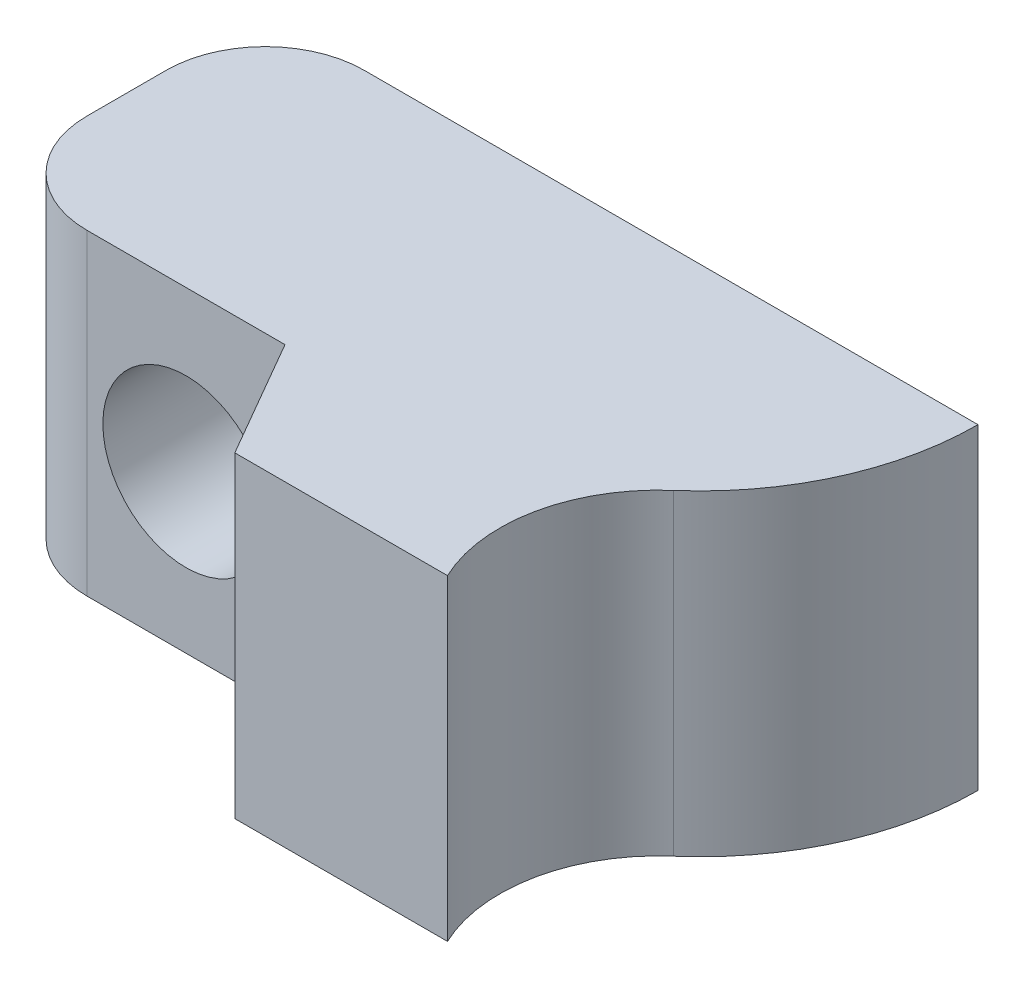
ISO-10303-21;
HEADER;
FILE_DESCRIPTION(('STEP AP214'),'2;1');
FILE_NAME('part.step','',(''),(''),'','','');
FILE_SCHEMA(('AUTOMOTIVE_DESIGN { 1 0 10303 214 1 1 1 1 }'));
ENDSEC;
DATA;
#1=APPLICATION_CONTEXT('core data for automotive mechanical design processes');
#2=APPLICATION_PROTOCOL_DEFINITION('international standard','automotive_design',2000,#1);
#3=PRODUCT_CONTEXT('',#1,'mechanical');
#4=PRODUCT('Part','Part','',(#3));
#5=PRODUCT_RELATED_PRODUCT_CATEGORY('part','',(#4));
#6=PRODUCT_DEFINITION_FORMATION('','',#4);
#7=PRODUCT_DEFINITION_CONTEXT('part definition',#1,'design');
#8=PRODUCT_DEFINITION('design','',#6,#7);
#9=PRODUCT_DEFINITION_SHAPE('','',#8);
#10=(LENGTH_UNIT() NAMED_UNIT(*) SI_UNIT(.MILLI.,.METRE.));
#11=(NAMED_UNIT(*) PLANE_ANGLE_UNIT() SI_UNIT($,.RADIAN.));
#12=(NAMED_UNIT(*) SI_UNIT($,.STERADIAN.) SOLID_ANGLE_UNIT());
#13=UNCERTAINTY_MEASURE_WITH_UNIT(LENGTH_MEASURE(1.E-05),#10,'distance_accuracy_value','');
#14=(GEOMETRIC_REPRESENTATION_CONTEXT(3) GLOBAL_UNCERTAINTY_ASSIGNED_CONTEXT((#13)) GLOBAL_UNIT_ASSIGNED_CONTEXT((#10,
#11,#12)) REPRESENTATION_CONTEXT('',''));
#15=CARTESIAN_POINT('',(0.,0.,0.));
#16=DIRECTION('',(0.,0.,1.));
#17=DIRECTION('',(1.,0.,0.));
#18=AXIS2_PLACEMENT_3D('',#15,#16,#17);
#19=CARTESIAN_POINT('',(0.,0.,10.));
#20=DIRECTION('',(0.,0.,-1.));
#21=DIRECTION('',(-1.,0.,0.));
#22=AXIS2_PLACEMENT_3D('',#19,#20,#21);
#23=CYLINDRICAL_SURFACE('',#22,1.6);
#24=CARTESIAN_POINT('',(0.,0.,0.));
#25=DIRECTION('',(0.,0.,1.));
#26=DIRECTION('',(1.,0.,0.));
#27=AXIS2_PLACEMENT_3D('',#24,#25,#26);
#28=CIRCLE('',#27,1.6);
#29=CARTESIAN_POINT('',(1.6,0.,0.));
#30=VERTEX_POINT('',#29);
#31=EDGE_CURVE('E150',#30,#30,#28,.T.);
#32=ORIENTED_EDGE('',*,*,#31,.F.);
#33=EDGE_LOOP('',(#32));
#34=FACE_BOUND('',#33,.T.);
#35=CARTESIAN_POINT('',(0.,0.,2.));
#36=DIRECTION('',(0.,0.,1.));
#37=DIRECTION('',(1.,0.,0.));
#38=AXIS2_PLACEMENT_3D('',#35,#36,#37);
#39=CIRCLE('',#38,1.6);
#40=CARTESIAN_POINT('',(1.6,0.,2.));
#41=VERTEX_POINT('',#40);
#42=EDGE_CURVE('E48',#41,#41,#39,.T.);
#43=ORIENTED_EDGE('',*,*,#42,.T.);
#44=EDGE_LOOP('',(#43));
#45=FACE_BOUND('',#44,.T.);
#46=ADVANCED_FACE('F44',(#34,#45),#23,.F.);
#47=CARTESIAN_POINT('',(0.,0.,10.));
#48=DIRECTION('',(0.,0.,1.));
#49=DIRECTION('',(1.,0.,0.));
#50=AXIS2_PLACEMENT_3D('',#47,#48,#49);
#51=PLANE('',#50);
#52=DIRECTION('',(0.,1.,0.));
#53=VECTOR('',#52,1.);
#54=CARTESIAN_POINT('',(4.23205080756887,-3.97230860622329,10.));
#55=LINE('',#54,#53);
#56=CARTESIAN_POINT('',(4.23205080756887,-3.9722536062233,10.));
#57=VERTEX_POINT('',#56);
#58=CARTESIAN_POINT('',(4.23205080756887,4.0277463937767,10.));
#59=VERTEX_POINT('',#58);
#60=EDGE_CURVE('E121',#57,#59,#55,.T.);
#61=ORIENTED_EDGE('',*,*,#60,.F.);
#62=DIRECTION('',(1.,0.,0.));
#63=VECTOR('',#62,1.);
#64=CARTESIAN_POINT('',(-5.,-3.9722536062233,10.));
#65=LINE('',#64,#63);
#66=CARTESIAN_POINT('',(9.60196826063411,-3.97225360622329,10.));
#67=VERTEX_POINT('',#66);
#68=EDGE_CURVE('E133',#57,#67,#65,.T.);
#69=ORIENTED_EDGE('',*,*,#68,.T.);
#70=DIRECTION('',(0.,-1.,0.));
#71=VECTOR('',#70,1.);
#72=CARTESIAN_POINT('',(9.6019682606341,4.02774639377671,10.));
#73=LINE('',#72,#71);
#74=CARTESIAN_POINT('',(9.6019682606341,4.02774639377671,10.));
#75=VERTEX_POINT('',#74);
#76=EDGE_CURVE('E191',#75,#67,#73,.T.);
#77=ORIENTED_EDGE('',*,*,#76,.F.);
#78=DIRECTION('',(-1.,0.,0.));
#79=VECTOR('',#78,1.);
#80=CARTESIAN_POINT('',(-5.,4.0277463937767,10.));
#81=LINE('',#80,#79);
#82=EDGE_CURVE('E136',#75,#59,#81,.T.);
#83=ORIENTED_EDGE('',*,*,#82,.T.);
#84=EDGE_LOOP('',(#61,#69,#77,#83));
#85=FACE_BOUND('',#84,.T.);
#86=ADVANCED_FACE('F131',(#85),#51,.T.);
#87=CARTESIAN_POINT('',(0.,0.,0.));
#88=DIRECTION('',(0.,0.,1.));
#89=DIRECTION('',(1.,0.,0.));
#90=AXIS2_PLACEMENT_3D('',#87,#88,#89);
#91=PLANE('',#90);
#92=DIRECTION('',(1.,0.,0.));
#93=VECTOR('',#92,1.);
#94=CARTESIAN_POINT('',(-5.,-3.9722536062233,0.));
#95=LINE('',#94,#93);
#96=CARTESIAN_POINT('',(-2.5,-3.9722536062233,0.));
#97=VERTEX_POINT('',#96);
#98=CARTESIAN_POINT('',(13.,-3.97225360622329,-8.872297427992E-13));
#99=VERTEX_POINT('',#98);
#100=EDGE_CURVE('E165',#97,#99,#95,.T.);
#101=ORIENTED_EDGE('',*,*,#100,.F.);
#102=DIRECTION('',(0.,-1.,0.));
#103=VECTOR('',#102,1.);
#104=CARTESIAN_POINT('',(-2.5,0.,0.));
#105=LINE('',#104,#103);
#106=CARTESIAN_POINT('',(-2.5,4.0277463937767,0.));
#107=VERTEX_POINT('',#106);
#108=EDGE_CURVE('E11',#97,#107,#105,.F.);
#109=ORIENTED_EDGE('',*,*,#108,.T.);
#110=DIRECTION('',(-1.,0.,0.));
#111=VECTOR('',#110,1.);
#112=CARTESIAN_POINT('',(-5.,4.0277463937767,0.));
#113=LINE('',#112,#111);
#114=CARTESIAN_POINT('',(13.,4.02774639377671,-8.872297427992E-13));
#115=VERTEX_POINT('',#114);
#116=EDGE_CURVE('E142',#115,#107,#113,.T.);
#117=ORIENTED_EDGE('',*,*,#116,.F.);
#118=DIRECTION('',(0.,1.,0.));
#119=VECTOR('',#118,1.);
#120=CARTESIAN_POINT('',(13.,4.0277463937767,0.));
#121=LINE('',#120,#119);
#122=EDGE_CURVE('E147',#99,#115,#121,.T.);
#123=ORIENTED_EDGE('',*,*,#122,.F.);
#124=EDGE_LOOP('',(#101,#109,#117,#123));
#125=FACE_BOUND('',#124,.T.);
#126=ORIENTED_EDGE('',*,*,#31,.T.);
#127=EDGE_LOOP('',(#126));
#128=FACE_BOUND('',#127,.T.);
#129=ADVANCED_FACE('F199',(#125,#128),#91,.F.);
#130=CARTESIAN_POINT('',(-5.,4.0277463937767,10.));
#131=DIRECTION('',(1.,0.,0.));
#132=DIRECTION('',(0.,1.,0.));
#133=AXIS2_PLACEMENT_3D('',#130,#131,#132);
#134=PLANE('',#133);
#135=DIRECTION('',(0.,0.,-1.));
#136=VECTOR('',#135,1.);
#137=CARTESIAN_POINT('',(-5.,-3.9722536062233,10.));
#138=LINE('',#137,#136);
#139=CARTESIAN_POINT('',(-5.,-3.9722536062233,4.5));
#140=VERTEX_POINT('',#139);
#141=CARTESIAN_POINT('',(-5.,-3.9722536062233,2.5));
#142=VERTEX_POINT('',#141);
#143=EDGE_CURVE('E155',#140,#142,#138,.T.);
#144=ORIENTED_EDGE('',*,*,#143,.F.);
#145=DIRECTION('',(0.,1.,0.));
#146=VECTOR('',#145,1.);
#147=CARTESIAN_POINT('',(-5.,4.0277463937767,4.5));
#148=LINE('',#147,#146);
#149=CARTESIAN_POINT('',(-5.,4.0277463937767,4.5));
#150=VERTEX_POINT('',#149);
#151=EDGE_CURVE('E254',#140,#150,#148,.T.);
#152=ORIENTED_EDGE('',*,*,#151,.T.);
#153=DIRECTION('',(0.,0.,-1.));
#154=VECTOR('',#153,1.);
#155=CARTESIAN_POINT('',(-5.,4.0277463937767,10.));
#156=LINE('',#155,#154);
#157=CARTESIAN_POINT('',(-5.,4.0277463937767,2.5));
#158=VERTEX_POINT('',#157);
#159=EDGE_CURVE('E144',#150,#158,#156,.T.);
#160=ORIENTED_EDGE('',*,*,#159,.T.);
#161=DIRECTION('',(0.,-1.,0.));
#162=VECTOR('',#161,1.);
#163=CARTESIAN_POINT('',(-5.,4.0277463937767,2.5));
#164=LINE('',#163,#162);
#165=EDGE_CURVE('E259',#158,#142,#164,.T.);
#166=ORIENTED_EDGE('',*,*,#165,.T.);
#167=EDGE_LOOP('',(#144,#152,#160,#166));
#168=FACE_BOUND('',#167,.T.);
#169=ADVANCED_FACE('F236',(#168),#134,.F.);
#170=CARTESIAN_POINT('',(-5.,-3.9722536062233,10.));
#171=DIRECTION('',(0.,1.,0.));
#172=DIRECTION('',(-1.,0.,0.));
#173=AXIS2_PLACEMENT_3D('',#170,#171,#172);
#174=PLANE('',#173);
#175=DIRECTION('',(-1.,0.,0.));
#176=VECTOR('',#175,1.);
#177=CARTESIAN_POINT('',(-5.,-3.9722536062233,7.));
#178=LINE('',#177,#176);
#179=CARTESIAN_POINT('',(2.5,-3.9722536062233,7.));
#180=VERTEX_POINT('',#179);
#181=CARTESIAN_POINT('',(-2.5,-3.9722536062233,7.));
#182=VERTEX_POINT('',#181);
#183=EDGE_CURVE('E127',#180,#182,#178,.T.);
#184=ORIENTED_EDGE('',*,*,#183,.T.);
#185=CARTESIAN_POINT('',(-2.5,-3.9722536062233,4.5));
#186=DIRECTION('',(0.,1.,0.));
#187=DIRECTION('',(-1.,0.,0.));
#188=AXIS2_PLACEMENT_3D('',#185,#186,#187);
#189=CIRCLE('',#188,2.5);
#190=EDGE_CURVE('E53',#182,#140,#189,.F.);
#191=ORIENTED_EDGE('',*,*,#190,.T.);
#192=ORIENTED_EDGE('',*,*,#143,.T.);
#193=CARTESIAN_POINT('',(-2.5,-3.9722536062233,2.5));
#194=DIRECTION('',(0.,1.,0.));
#195=DIRECTION('',(-1.,0.,0.));
#196=AXIS2_PLACEMENT_3D('',#193,#194,#195);
#197=CIRCLE('',#196,2.5);
#198=EDGE_CURVE('E61',#142,#97,#197,.F.);
#199=ORIENTED_EDGE('',*,*,#198,.T.);
#200=ORIENTED_EDGE('',*,*,#100,.T.);
#201=CARTESIAN_POINT('',(5.99999999999998,-3.97225360622329,0.));
#202=DIRECTION('',(0.,1.,0.));
#203=DIRECTION('',(-1.,0.,0.));
#204=AXIS2_PLACEMENT_3D('',#201,#202,#203);
#205=CIRCLE('',#204,6.99999999999999);
#206=CARTESIAN_POINT('',(10.5955484919901,-3.97225360622329,5.28023996213876));
#207=VERTEX_POINT('',#206);
#208=EDGE_CURVE('E193',#99,#207,#205,.F.);
#209=ORIENTED_EDGE('',*,*,#208,.T.);
#210=CARTESIAN_POINT('',(13.2215762016987,-3.97225360622329,8.2975199405038));
#211=DIRECTION('',(0.,1.,0.));
#212=DIRECTION('',(-1.,0.,0.));
#213=AXIS2_PLACEMENT_3D('',#210,#211,#212);
#214=CIRCLE('',#213,4.00000000000002);
#215=EDGE_CURVE('E141',#207,#67,#214,.T.);
#216=ORIENTED_EDGE('',*,*,#215,.T.);
#217=ORIENTED_EDGE('',*,*,#68,.F.);
#218=DIRECTION('',(-0.499999999999998,0.,-0.86602540378444));
#219=VECTOR('',#218,1.);
#220=CARTESIAN_POINT('',(1.92403810567667,-3.9722536062233,6.00240473580837));
#221=LINE('',#220,#219);
#222=EDGE_CURVE('E117',#57,#180,#221,.T.);
#223=ORIENTED_EDGE('',*,*,#222,.T.);
#224=EDGE_LOOP('',(#184,#191,#192,#199,#200,#209,#216,#217,#223));
#225=FACE_BOUND('',#224,.T.);
#226=ADVANCED_FACE('F139',(#225),#174,.F.);
#227=CARTESIAN_POINT('',(-5.,4.0277463937767,10.));
#228=DIRECTION('',(0.,-1.,0.));
#229=DIRECTION('',(1.,0.,0.));
#230=AXIS2_PLACEMENT_3D('',#227,#228,#229);
#231=PLANE('',#230);
#232=ORIENTED_EDGE('',*,*,#159,.F.);
#233=CARTESIAN_POINT('',(-2.5,4.0277463937767,4.5));
#234=DIRECTION('',(0.,-1.,0.));
#235=DIRECTION('',(1.,0.,0.));
#236=AXIS2_PLACEMENT_3D('',#233,#234,#235);
#237=CIRCLE('',#236,2.5);
#238=CARTESIAN_POINT('',(-2.5,4.0277463937767,7.));
#239=VERTEX_POINT('',#238);
#240=EDGE_CURVE('E266',#150,#239,#237,.F.);
#241=ORIENTED_EDGE('',*,*,#240,.T.);
#242=DIRECTION('',(1.,0.,0.));
#243=VECTOR('',#242,1.);
#244=CARTESIAN_POINT('',(-5.,4.0277463937767,7.));
#245=LINE('',#244,#243);
#246=CARTESIAN_POINT('',(2.5,4.0277463937767,7.));
#247=VERTEX_POINT('',#246);
#248=EDGE_CURVE('E181',#239,#247,#245,.T.);
#249=ORIENTED_EDGE('',*,*,#248,.T.);
#250=DIRECTION('',(0.499999999999998,0.,0.86602540378444));
#251=VECTOR('',#250,1.);
#252=CARTESIAN_POINT('',(1.92403810567667,4.0277463937767,6.00240473580837));
#253=LINE('',#252,#251);
#254=EDGE_CURVE('E160',#247,#59,#253,.T.);
#255=ORIENTED_EDGE('',*,*,#254,.T.);
#256=ORIENTED_EDGE('',*,*,#82,.F.);
#257=CARTESIAN_POINT('',(13.2215762016987,4.0277463937767,8.2975199405038));
#258=DIRECTION('',(0.,-1.,0.));
#259=DIRECTION('',(1.,0.,0.));
#260=AXIS2_PLACEMENT_3D('',#257,#258,#259);
#261=CIRCLE('',#260,4.00000000000002);
#262=CARTESIAN_POINT('',(10.5955484919901,4.0277463937767,5.28023996213876));
#263=VERTEX_POINT('',#262);
#264=EDGE_CURVE('E157',#75,#263,#261,.T.);
#265=ORIENTED_EDGE('',*,*,#264,.T.);
#266=CARTESIAN_POINT('',(5.99999999999998,4.02774639377671,0.));
#267=DIRECTION('',(0.,1.,0.));
#268=DIRECTION('',(1.,0.,0.));
#269=AXIS2_PLACEMENT_3D('',#266,#267,#268);
#270=CIRCLE('',#269,6.99999999999999);
#271=EDGE_CURVE('E126',#263,#115,#270,.T.);
#272=ORIENTED_EDGE('',*,*,#271,.T.);
#273=ORIENTED_EDGE('',*,*,#116,.T.);
#274=CARTESIAN_POINT('',(-2.5,4.0277463937767,2.5));
#275=DIRECTION('',(0.,-1.,0.));
#276=DIRECTION('',(1.,0.,0.));
#277=AXIS2_PLACEMENT_3D('',#274,#275,#276);
#278=CIRCLE('',#277,2.5);
#279=EDGE_CURVE('E262',#107,#158,#278,.F.);
#280=ORIENTED_EDGE('',*,*,#279,.T.);
#281=EDGE_LOOP('',(#232,#241,#249,#255,#256,#265,#272,#273,#280));
#282=FACE_BOUND('',#281,.T.);
#283=ADVANCED_FACE('F229',(#282),#231,.F.);
#284=CARTESIAN_POINT('',(5.99999999999998,4.02774639377671,0.));
#285=DIRECTION('',(0.,-1.,0.));
#286=DIRECTION('',(1.,0.,0.));
#287=AXIS2_PLACEMENT_3D('',#284,#285,#286);
#288=CYLINDRICAL_SURFACE('',#287,6.99999999999999);
#289=ORIENTED_EDGE('',*,*,#122,.T.);
#290=ORIENTED_EDGE('',*,*,#271,.F.);
#291=DIRECTION('',(0.,-1.,0.));
#292=VECTOR('',#291,1.);
#293=CARTESIAN_POINT('',(10.5955484919901,4.02774639377671,5.28023996213876));
#294=LINE('',#293,#292);
#295=EDGE_CURVE('E187',#263,#207,#294,.T.);
#296=ORIENTED_EDGE('',*,*,#295,.T.);
#297=ORIENTED_EDGE('',*,*,#208,.F.);
#298=EDGE_LOOP('',(#289,#290,#296,#297));
#299=FACE_BOUND('',#298,.T.);
#300=ADVANCED_FACE('F226',(#299),#288,.T.);
#301=CARTESIAN_POINT('',(13.2215762016987,4.02774639377671,8.2975199405038));
#302=DIRECTION('',(0.,-1.,0.));
#303=DIRECTION('',(1.,0.,0.));
#304=AXIS2_PLACEMENT_3D('',#301,#302,#303);
#305=CYLINDRICAL_SURFACE('',#304,4.00000000000002);
#306=ORIENTED_EDGE('',*,*,#76,.T.);
#307=ORIENTED_EDGE('',*,*,#215,.F.);
#308=ORIENTED_EDGE('',*,*,#295,.F.);
#309=ORIENTED_EDGE('',*,*,#264,.F.);
#310=EDGE_LOOP('',(#306,#307,#308,#309));
#311=FACE_BOUND('',#310,.T.);
#312=ADVANCED_FACE('F223',(#311),#305,.F.);
#313=CARTESIAN_POINT('',(2.5,-3.97230860622329,7.));
#314=DIRECTION('',(0.86602540378444,0.,-0.499999999999998));
#315=DIRECTION('',(-0.499999999999998,0.,-0.86602540378444));
#316=AXIS2_PLACEMENT_3D('',#313,#314,#315);
#317=PLANE('',#316);
#318=ORIENTED_EDGE('',*,*,#60,.T.);
#319=ORIENTED_EDGE('',*,*,#254,.F.);
#320=DIRECTION('',(0.,1.,0.));
#321=VECTOR('',#320,1.);
#322=CARTESIAN_POINT('',(2.5,-3.97230860622329,7.));
#323=LINE('',#322,#321);
#324=EDGE_CURVE('E124',#180,#247,#323,.T.);
#325=ORIENTED_EDGE('',*,*,#324,.F.);
#326=ORIENTED_EDGE('',*,*,#222,.F.);
#327=EDGE_LOOP('',(#318,#319,#325,#326));
#328=FACE_BOUND('',#327,.T.);
#329=ADVANCED_FACE('F119',(#328),#317,.F.);
#330=CARTESIAN_POINT('',(-5.,-3.97230860622329,7.));
#331=DIRECTION('',(0.,0.,-1.));
#332=DIRECTION('',(-1.,0.,0.));
#333=AXIS2_PLACEMENT_3D('',#330,#331,#332);
#334=PLANE('',#333);
#335=CARTESIAN_POINT('',(0.,0.,7.));
#336=DIRECTION('',(0.,0.,-1.));
#337=DIRECTION('',(-1.,0.,0.));
#338=AXIS2_PLACEMENT_3D('',#335,#336,#337);
#339=CIRCLE('',#338,2.1);
#340=CARTESIAN_POINT('',(-2.1,0.,7.));
#341=VERTEX_POINT('',#340);
#342=EDGE_CURVE('E170',#341,#341,#339,.F.);
#343=ORIENTED_EDGE('',*,*,#342,.F.);
#344=EDGE_LOOP('',(#343));
#345=FACE_BOUND('',#344,.T.);
#346=ORIENTED_EDGE('',*,*,#248,.F.);
#347=DIRECTION('',(0.,1.,0.));
#348=VECTOR('',#347,1.);
#349=CARTESIAN_POINT('',(-2.5,-3.97230860622329,7.));
#350=LINE('',#349,#348);
#351=EDGE_CURVE('E69',#239,#182,#350,.F.);
#352=ORIENTED_EDGE('',*,*,#351,.T.);
#353=ORIENTED_EDGE('',*,*,#183,.F.);
#354=ORIENTED_EDGE('',*,*,#324,.T.);
#355=EDGE_LOOP('',(#346,#352,#353,#354));
#356=FACE_BOUND('',#355,.T.);
#357=ADVANCED_FACE('F216',(#345,#356),#334,.F.);
#358=CARTESIAN_POINT('',(-2.5,4.0277463937767,4.5));
#359=DIRECTION('',(0.,1.,0.));
#360=DIRECTION('',(-1.,0.,0.));
#361=AXIS2_PLACEMENT_3D('',#358,#359,#360);
#362=CYLINDRICAL_SURFACE('',#361,2.5);
#363=ORIENTED_EDGE('',*,*,#190,.F.);
#364=ORIENTED_EDGE('',*,*,#351,.F.);
#365=ORIENTED_EDGE('',*,*,#240,.F.);
#366=ORIENTED_EDGE('',*,*,#151,.F.);
#367=EDGE_LOOP('',(#363,#364,#365,#366));
#368=FACE_BOUND('',#367,.T.);
#369=ADVANCED_FACE('F219',(#368),#362,.T.);
#370=CARTESIAN_POINT('',(-2.5,4.0277463937767,2.5));
#371=DIRECTION('',(0.,-1.,0.));
#372=DIRECTION('',(1.,0.,0.));
#373=AXIS2_PLACEMENT_3D('',#370,#371,#372);
#374=CYLINDRICAL_SURFACE('',#373,2.5);
#375=ORIENTED_EDGE('',*,*,#279,.F.);
#376=ORIENTED_EDGE('',*,*,#108,.F.);
#377=ORIENTED_EDGE('',*,*,#198,.F.);
#378=ORIENTED_EDGE('',*,*,#165,.F.);
#379=EDGE_LOOP('',(#375,#376,#377,#378));
#380=FACE_BOUND('',#379,.T.);
#381=ADVANCED_FACE('F46',(#380),#374,.T.);
#382=CARTESIAN_POINT('',(0.,0.,10.));
#383=DIRECTION('',(0.,0.,-1.));
#384=DIRECTION('',(-1.,0.,0.));
#385=AXIS2_PLACEMENT_3D('',#382,#383,#384);
#386=CYLINDRICAL_SURFACE('',#385,2.1);
#387=CARTESIAN_POINT('',(0.,0.,2.));
#388=DIRECTION('',(0.,0.,1.));
#389=DIRECTION('',(1.,0.,0.));
#390=AXIS2_PLACEMENT_3D('',#387,#388,#389);
#391=CIRCLE('',#390,2.1);
#392=CARTESIAN_POINT('',(2.1,0.,2.));
#393=VERTEX_POINT('',#392);
#394=EDGE_CURVE('E172',#393,#393,#391,.T.);
#395=ORIENTED_EDGE('',*,*,#394,.F.);
#396=EDGE_LOOP('',(#395));
#397=FACE_BOUND('',#396,.T.);
#398=ORIENTED_EDGE('',*,*,#342,.T.);
#399=EDGE_LOOP('',(#398));
#400=FACE_BOUND('',#399,.T.);
#401=ADVANCED_FACE('F208',(#397,#400),#386,.F.);
#402=CARTESIAN_POINT('',(0.,0.,2.));
#403=DIRECTION('',(0.,0.,1.));
#404=DIRECTION('',(1.,0.,0.));
#405=AXIS2_PLACEMENT_3D('',#402,#403,#404);
#406=PLANE('',#405);
#407=ORIENTED_EDGE('',*,*,#42,.F.);
#408=EDGE_LOOP('',(#407));
#409=FACE_BOUND('',#408,.T.);
#410=ORIENTED_EDGE('',*,*,#394,.T.);
#411=EDGE_LOOP('',(#410));
#412=FACE_BOUND('',#411,.T.);
#413=ADVANCED_FACE('F206',(#409,#412),#406,.T.);
#414=CLOSED_SHELL('',(#46,#86,#129,#169,#226,#283,#300,#312,#329,#357,#369,#381,#401,#413));
#415=MANIFOLD_SOLID_BREP('B2',#414);
#416=ADVANCED_BREP_SHAPE_REPRESENTATION('',(#18,#415),#14);
#417=SHAPE_DEFINITION_REPRESENTATION(#9,#416);
ENDSEC;
END-ISO-10303-21;
